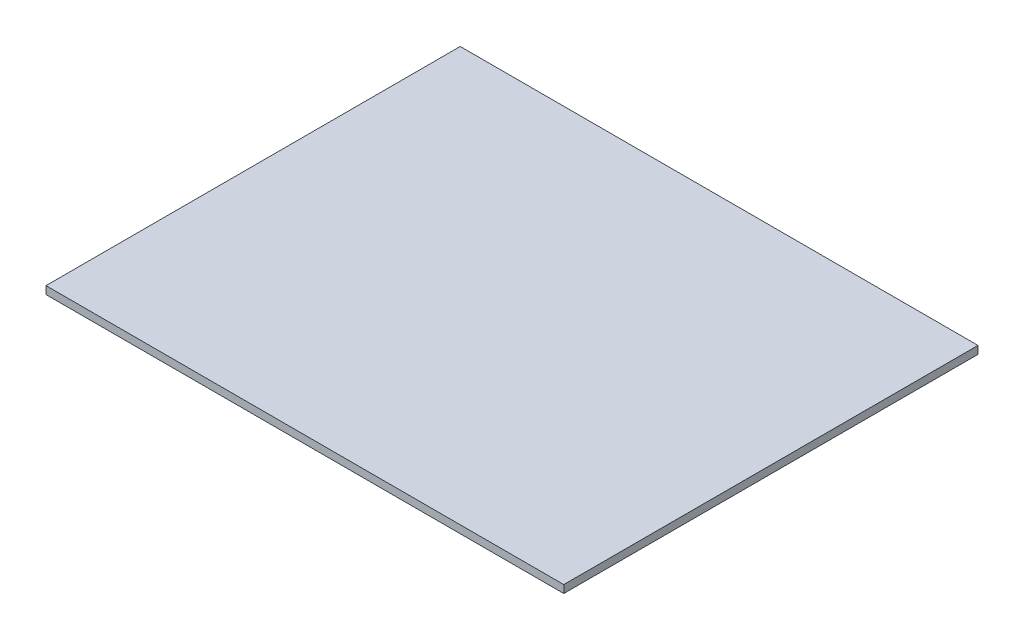
ISO-10303-21;
HEADER;
FILE_DESCRIPTION(('STEP AP214'),'2;1');
FILE_NAME('part.step','',(''),(''),'','','');
FILE_SCHEMA(('AUTOMOTIVE_DESIGN { 1 0 10303 214 1 1 1 1 }'));
ENDSEC;
DATA;
#1=APPLICATION_CONTEXT('core data for automotive mechanical design processes');
#2=APPLICATION_PROTOCOL_DEFINITION('international standard','automotive_design',2000,#1);
#3=PRODUCT_CONTEXT('',#1,'mechanical');
#4=PRODUCT('Part','Part','',(#3));
#5=PRODUCT_RELATED_PRODUCT_CATEGORY('part','',(#4));
#6=PRODUCT_DEFINITION_FORMATION('','',#4);
#7=PRODUCT_DEFINITION_CONTEXT('part definition',#1,'design');
#8=PRODUCT_DEFINITION('design','',#6,#7);
#9=PRODUCT_DEFINITION_SHAPE('','',#8);
#10=(LENGTH_UNIT() NAMED_UNIT(*) SI_UNIT(.MILLI.,.METRE.));
#11=(NAMED_UNIT(*) PLANE_ANGLE_UNIT() SI_UNIT($,.RADIAN.));
#12=(NAMED_UNIT(*) SI_UNIT($,.STERADIAN.) SOLID_ANGLE_UNIT());
#13=UNCERTAINTY_MEASURE_WITH_UNIT(LENGTH_MEASURE(1.E-05),#10,'distance_accuracy_value','');
#14=(GEOMETRIC_REPRESENTATION_CONTEXT(3) GLOBAL_UNCERTAINTY_ASSIGNED_CONTEXT((#13)) GLOBAL_UNIT_ASSIGNED_CONTEXT((#10,
#11,#12)) REPRESENTATION_CONTEXT('',''));
#15=CARTESIAN_POINT('',(0.,0.,0.));
#16=DIRECTION('',(0.,0.,1.));
#17=DIRECTION('',(1.,0.,0.));
#18=AXIS2_PLACEMENT_3D('',#15,#16,#17);
#19=CARTESIAN_POINT('',(0.,4.7625,0.));
#20=DIRECTION('',(1.,0.,0.));
#21=DIRECTION('',(0.,0.,-1.));
#22=AXIS2_PLACEMENT_3D('',#19,#20,#21);
#23=PLANE('',#22);
#24=DIRECTION('',(0.,0.,1.));
#25=VECTOR('',#24,1.);
#26=CARTESIAN_POINT('',(0.,0.,0.));
#27=LINE('',#26,#25);
#28=CARTESIAN_POINT('',(0.,0.,0.));
#29=VERTEX_POINT('',#28);
#30=CARTESIAN_POINT('',(0.,0.,254.));
#31=VERTEX_POINT('',#30);
#32=EDGE_CURVE('E96',#29,#31,#27,.T.);
#33=ORIENTED_EDGE('',*,*,#32,.T.);
#34=DIRECTION('',(0.,-1.,0.));
#35=VECTOR('',#34,1.);
#36=CARTESIAN_POINT('',(0.,4.7625,254.));
#37=LINE('',#36,#35);
#38=CARTESIAN_POINT('',(0.,4.7625,254.));
#39=VERTEX_POINT('',#38);
#40=EDGE_CURVE('E11',#39,#31,#37,.T.);
#41=ORIENTED_EDGE('',*,*,#40,.F.);
#42=DIRECTION('',(0.,0.,1.));
#43=VECTOR('',#42,1.);
#44=CARTESIAN_POINT('',(0.,4.7625,0.));
#45=LINE('',#44,#43);
#46=CARTESIAN_POINT('',(0.,4.7625,0.));
#47=VERTEX_POINT('',#46);
#48=EDGE_CURVE('E82',#47,#39,#45,.T.);
#49=ORIENTED_EDGE('',*,*,#48,.F.);
#50=DIRECTION('',(0.,-1.,0.));
#51=VECTOR('',#50,1.);
#52=CARTESIAN_POINT('',(0.,4.7625,0.));
#53=LINE('',#52,#51);
#54=EDGE_CURVE('E49',#47,#29,#53,.T.);
#55=ORIENTED_EDGE('',*,*,#54,.T.);
#56=EDGE_LOOP('',(#33,#41,#49,#55));
#57=FACE_BOUND('',#56,.T.);
#58=ADVANCED_FACE('F33',(#57),#23,.F.);
#59=CARTESIAN_POINT('',(0.,4.7625,254.));
#60=DIRECTION('',(0.,0.,-1.));
#61=DIRECTION('',(-1.,0.,0.));
#62=AXIS2_PLACEMENT_3D('',#59,#60,#61);
#63=PLANE('',#62);
#64=DIRECTION('',(1.,0.,0.));
#65=VECTOR('',#64,1.);
#66=CARTESIAN_POINT('',(0.,0.,254.));
#67=LINE('',#66,#65);
#68=CARTESIAN_POINT('',(317.5,0.,254.));
#69=VERTEX_POINT('',#68);
#70=EDGE_CURVE('E87',#31,#69,#67,.T.);
#71=ORIENTED_EDGE('',*,*,#70,.T.);
#72=DIRECTION('',(0.,-1.,0.));
#73=VECTOR('',#72,1.);
#74=CARTESIAN_POINT('',(317.5,4.7625,254.));
#75=LINE('',#74,#73);
#76=CARTESIAN_POINT('',(317.5,4.7625,254.));
#77=VERTEX_POINT('',#76);
#78=EDGE_CURVE('E41',#77,#69,#75,.T.);
#79=ORIENTED_EDGE('',*,*,#78,.F.);
#80=DIRECTION('',(1.,0.,0.));
#81=VECTOR('',#80,1.);
#82=CARTESIAN_POINT('',(0.,4.7625,254.));
#83=LINE('',#82,#81);
#84=EDGE_CURVE('E74',#39,#77,#83,.T.);
#85=ORIENTED_EDGE('',*,*,#84,.F.);
#86=ORIENTED_EDGE('',*,*,#40,.T.);
#87=EDGE_LOOP('',(#71,#79,#85,#86));
#88=FACE_BOUND('',#87,.T.);
#89=ADVANCED_FACE('F86',(#88),#63,.F.);
#90=CARTESIAN_POINT('',(317.5,4.7625,0.));
#91=DIRECTION('',(1.,0.,0.));
#92=DIRECTION('',(0.,0.,-1.));
#93=AXIS2_PLACEMENT_3D('',#90,#91,#92);
#94=PLANE('',#93);
#95=DIRECTION('',(0.,0.,1.));
#96=VECTOR('',#95,1.);
#97=CARTESIAN_POINT('',(317.5,0.,0.));
#98=LINE('',#97,#96);
#99=CARTESIAN_POINT('',(317.5,0.,0.));
#100=VERTEX_POINT('',#99);
#101=EDGE_CURVE('E99',#100,#69,#98,.T.);
#102=ORIENTED_EDGE('',*,*,#101,.F.);
#103=DIRECTION('',(0.,-1.,0.));
#104=VECTOR('',#103,1.);
#105=CARTESIAN_POINT('',(317.5,4.7625,0.));
#106=LINE('',#105,#104);
#107=CARTESIAN_POINT('',(317.5,4.7625,0.));
#108=VERTEX_POINT('',#107);
#109=EDGE_CURVE('E63',#108,#100,#106,.T.);
#110=ORIENTED_EDGE('',*,*,#109,.F.);
#111=DIRECTION('',(0.,0.,1.));
#112=VECTOR('',#111,1.);
#113=CARTESIAN_POINT('',(317.5,4.7625,0.));
#114=LINE('',#113,#112);
#115=EDGE_CURVE('E81',#108,#77,#114,.T.);
#116=ORIENTED_EDGE('',*,*,#115,.T.);
#117=ORIENTED_EDGE('',*,*,#78,.T.);
#118=EDGE_LOOP('',(#102,#110,#116,#117));
#119=FACE_BOUND('',#118,.T.);
#120=ADVANCED_FACE('F90',(#119),#94,.T.);
#121=CARTESIAN_POINT('',(0.,4.7625,0.));
#122=DIRECTION('',(0.,0.,-1.));
#123=DIRECTION('',(-1.,0.,0.));
#124=AXIS2_PLACEMENT_3D('',#121,#122,#123);
#125=PLANE('',#124);
#126=DIRECTION('',(1.,0.,0.));
#127=VECTOR('',#126,1.);
#128=CARTESIAN_POINT('',(0.,0.,0.));
#129=LINE('',#128,#127);
#130=EDGE_CURVE('E101',#29,#100,#129,.T.);
#131=ORIENTED_EDGE('',*,*,#130,.F.);
#132=ORIENTED_EDGE('',*,*,#54,.F.);
#133=DIRECTION('',(1.,0.,0.));
#134=VECTOR('',#133,1.);
#135=CARTESIAN_POINT('',(0.,4.7625,0.));
#136=LINE('',#135,#134);
#137=EDGE_CURVE('E91',#47,#108,#136,.T.);
#138=ORIENTED_EDGE('',*,*,#137,.T.);
#139=ORIENTED_EDGE('',*,*,#109,.T.);
#140=EDGE_LOOP('',(#131,#132,#138,#139));
#141=FACE_BOUND('',#140,.T.);
#142=ADVANCED_FACE('F107',(#141),#125,.T.);
#143=CARTESIAN_POINT('',(0.,4.7625,0.));
#144=DIRECTION('',(0.,1.,0.));
#145=DIRECTION('',(0.,0.,1.));
#146=AXIS2_PLACEMENT_3D('',#143,#144,#145);
#147=PLANE('',#146);
#148=ORIENTED_EDGE('',*,*,#48,.T.);
#149=ORIENTED_EDGE('',*,*,#84,.T.);
#150=ORIENTED_EDGE('',*,*,#115,.F.);
#151=ORIENTED_EDGE('',*,*,#137,.F.);
#152=EDGE_LOOP('',(#148,#149,#150,#151));
#153=FACE_BOUND('',#152,.T.);
#154=ADVANCED_FACE('F78',(#153),#147,.T.);
#155=CARTESIAN_POINT('',(0.,0.,0.));
#156=DIRECTION('',(0.,1.,0.));
#157=DIRECTION('',(0.,0.,1.));
#158=AXIS2_PLACEMENT_3D('',#155,#156,#157);
#159=PLANE('',#158);
#160=ORIENTED_EDGE('',*,*,#32,.F.);
#161=ORIENTED_EDGE('',*,*,#130,.T.);
#162=ORIENTED_EDGE('',*,*,#101,.T.);
#163=ORIENTED_EDGE('',*,*,#70,.F.);
#164=EDGE_LOOP('',(#160,#161,#162,#163));
#165=FACE_BOUND('',#164,.T.);
#166=ADVANCED_FACE('F106',(#165),#159,.F.);
#167=CLOSED_SHELL('',(#58,#89,#120,#142,#154,#166));
#168=MANIFOLD_SOLID_BREP('B2',#167);
#169=ADVANCED_BREP_SHAPE_REPRESENTATION('',(#18,#168),#14);
#170=SHAPE_DEFINITION_REPRESENTATION(#9,#169);
ENDSEC;
END-ISO-10303-21;
